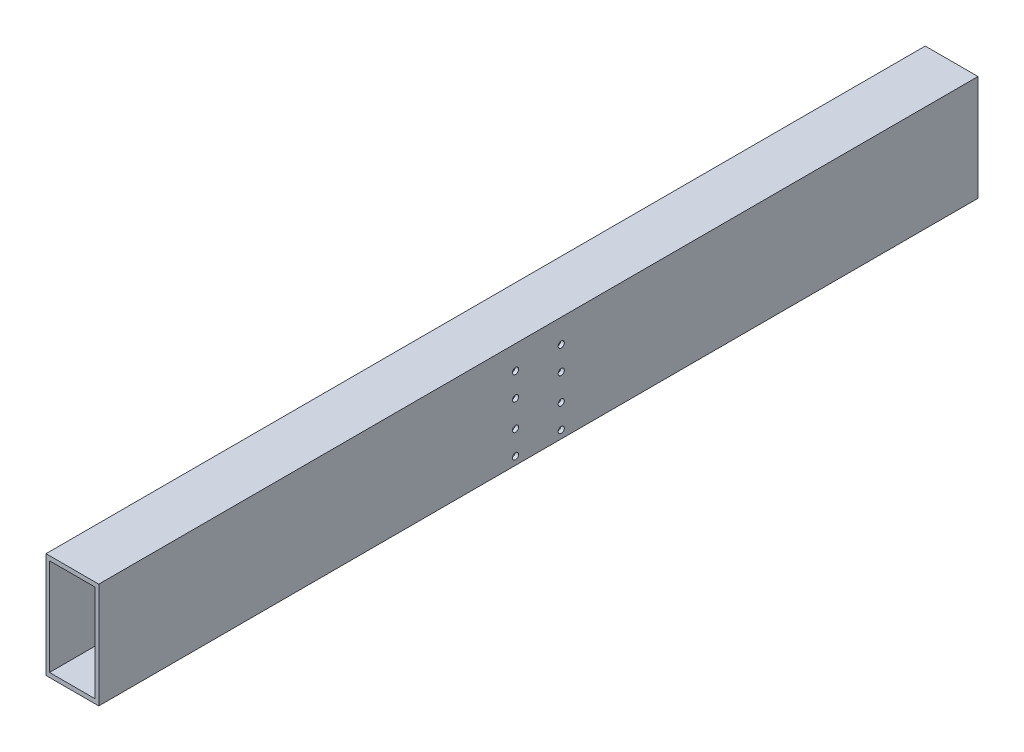
ISO-10303-21;
HEADER;
FILE_DESCRIPTION(('STEP AP214'),'2;1');
FILE_NAME('part.step','',(''),(''),'','','');
FILE_SCHEMA(('AUTOMOTIVE_DESIGN { 1 0 10303 214 1 1 1 1 }'));
ENDSEC;
DATA;
#1=APPLICATION_CONTEXT('core data for automotive mechanical design processes');
#2=APPLICATION_PROTOCOL_DEFINITION('international standard','automotive_design',2000,#1);
#3=PRODUCT_CONTEXT('',#1,'mechanical');
#4=PRODUCT('Part','Part','',(#3));
#5=PRODUCT_RELATED_PRODUCT_CATEGORY('part','',(#4));
#6=PRODUCT_DEFINITION_FORMATION('','',#4);
#7=PRODUCT_DEFINITION_CONTEXT('part definition',#1,'design');
#8=PRODUCT_DEFINITION('design','',#6,#7);
#9=PRODUCT_DEFINITION_SHAPE('','',#8);
#10=(LENGTH_UNIT() NAMED_UNIT(*) SI_UNIT(.MILLI.,.METRE.));
#11=(NAMED_UNIT(*) PLANE_ANGLE_UNIT() SI_UNIT($,.RADIAN.));
#12=(NAMED_UNIT(*) SI_UNIT($,.STERADIAN.) SOLID_ANGLE_UNIT());
#13=UNCERTAINTY_MEASURE_WITH_UNIT(LENGTH_MEASURE(1.E-05),#10,'distance_accuracy_value','');
#14=(GEOMETRIC_REPRESENTATION_CONTEXT(3) GLOBAL_UNCERTAINTY_ASSIGNED_CONTEXT((#13)) GLOBAL_UNIT_ASSIGNED_CONTEXT((#10,
#11,#12)) REPRESENTATION_CONTEXT('',''));
#15=CARTESIAN_POINT('',(0.,0.,0.));
#16=DIRECTION('',(0.,0.,1.));
#17=DIRECTION('',(1.,0.,0.));
#18=AXIS2_PLACEMENT_3D('',#15,#16,#17);
#19=CARTESIAN_POINT('',(-30.,60.,500.));
#20=DIRECTION('',(1.,0.,0.));
#21=DIRECTION('',(0.,0.,-1.));
#22=AXIS2_PLACEMENT_3D('',#19,#20,#21);
#23=PLANE('',#22);
#24=CARTESIAN_POINT('',(-30.,33.,26.));
#25=DIRECTION('',(1.,0.,0.));
#26=DIRECTION('',(0.,0.,-1.));
#27=AXIS2_PLACEMENT_3D('',#24,#25,#26);
#28=CIRCLE('',#27,3.49999999999999);
#29=CARTESIAN_POINT('',(-30.,33.,22.5));
#30=VERTEX_POINT('',#29);
#31=EDGE_CURVE('E539',#30,#30,#28,.T.);
#32=ORIENTED_EDGE('',*,*,#31,.T.);
#33=EDGE_LOOP('',(#32));
#34=FACE_BOUND('',#33,.T.);
#35=CARTESIAN_POINT('',(-30.,6.00000000000001,26.));
#36=DIRECTION('',(1.,0.,0.));
#37=DIRECTION('',(0.,0.,-1.));
#38=AXIS2_PLACEMENT_3D('',#35,#36,#37);
#39=CIRCLE('',#38,3.49999999999999);
#40=CARTESIAN_POINT('',(-30.,6.00000000000001,22.5));
#41=VERTEX_POINT('',#40);
#42=EDGE_CURVE('E553',#41,#41,#39,.T.);
#43=ORIENTED_EDGE('',*,*,#42,.T.);
#44=EDGE_LOOP('',(#43));
#45=FACE_BOUND('',#44,.T.);
#46=CARTESIAN_POINT('',(-30.,-24.,26.));
#47=DIRECTION('',(1.,0.,0.));
#48=DIRECTION('',(0.,0.,-1.));
#49=AXIS2_PLACEMENT_3D('',#46,#47,#48);
#50=CIRCLE('',#49,3.49999999999999);
#51=CARTESIAN_POINT('',(-30.,-24.,22.5));
#52=VERTEX_POINT('',#51);
#53=EDGE_CURVE('E148',#52,#52,#50,.T.);
#54=ORIENTED_EDGE('',*,*,#53,.T.);
#55=EDGE_LOOP('',(#54));
#56=FACE_BOUND('',#55,.T.);
#57=CARTESIAN_POINT('',(-30.,-51.,26.));
#58=DIRECTION('',(1.,0.,0.));
#59=DIRECTION('',(0.,0.,-1.));
#60=AXIS2_PLACEMENT_3D('',#57,#58,#59);
#61=CIRCLE('',#60,3.49999999999999);
#62=CARTESIAN_POINT('',(-30.,-51.,22.5));
#63=VERTEX_POINT('',#62);
#64=EDGE_CURVE('E144',#63,#63,#61,.T.);
#65=ORIENTED_EDGE('',*,*,#64,.T.);
#66=EDGE_LOOP('',(#65));
#67=FACE_BOUND('',#66,.T.);
#68=CARTESIAN_POINT('',(-30.,33.,-26.));
#69=DIRECTION('',(1.,0.,0.));
#70=DIRECTION('',(0.,0.,-1.));
#71=AXIS2_PLACEMENT_3D('',#68,#69,#70);
#72=CIRCLE('',#71,3.49999999999999);
#73=CARTESIAN_POINT('',(-30.,33.,-29.5));
#74=VERTEX_POINT('',#73);
#75=EDGE_CURVE('E140',#74,#74,#72,.T.);
#76=ORIENTED_EDGE('',*,*,#75,.T.);
#77=EDGE_LOOP('',(#76));
#78=FACE_BOUND('',#77,.T.);
#79=CARTESIAN_POINT('',(-30.,6.00000000000001,-26.));
#80=DIRECTION('',(1.,0.,0.));
#81=DIRECTION('',(0.,0.,-1.));
#82=AXIS2_PLACEMENT_3D('',#79,#80,#81);
#83=CIRCLE('',#82,3.49999999999999);
#84=CARTESIAN_POINT('',(-30.,6.00000000000001,-29.5));
#85=VERTEX_POINT('',#84);
#86=EDGE_CURVE('E135',#85,#85,#83,.T.);
#87=ORIENTED_EDGE('',*,*,#86,.T.);
#88=EDGE_LOOP('',(#87));
#89=FACE_BOUND('',#88,.T.);
#90=CARTESIAN_POINT('',(-30.,-24.,-26.));
#91=DIRECTION('',(1.,0.,0.));
#92=DIRECTION('',(0.,0.,-1.));
#93=AXIS2_PLACEMENT_3D('',#90,#91,#92);
#94=CIRCLE('',#93,3.49999999999999);
#95=CARTESIAN_POINT('',(-30.,-24.,-29.5));
#96=VERTEX_POINT('',#95);
#97=EDGE_CURVE('E130',#96,#96,#94,.T.);
#98=ORIENTED_EDGE('',*,*,#97,.T.);
#99=EDGE_LOOP('',(#98));
#100=FACE_BOUND('',#99,.T.);
#101=CARTESIAN_POINT('',(-30.,-51.,-26.));
#102=DIRECTION('',(1.,0.,0.));
#103=DIRECTION('',(0.,0.,-1.));
#104=AXIS2_PLACEMENT_3D('',#101,#102,#103);
#105=CIRCLE('',#104,3.49999999999999);
#106=CARTESIAN_POINT('',(-30.,-51.,-29.5));
#107=VERTEX_POINT('',#106);
#108=EDGE_CURVE('E125',#107,#107,#105,.T.);
#109=ORIENTED_EDGE('',*,*,#108,.T.);
#110=EDGE_LOOP('',(#109));
#111=FACE_BOUND('',#110,.T.);
#112=DIRECTION('',(0.,0.,-1.));
#113=VECTOR('',#112,1.);
#114=CARTESIAN_POINT('',(-30.,-60.,500.));
#115=LINE('',#114,#113);
#116=CARTESIAN_POINT('',(-30.,-60.,500.));
#117=VERTEX_POINT('',#116);
#118=CARTESIAN_POINT('',(-30.,-60.,-500.));
#119=VERTEX_POINT('',#118);
#120=EDGE_CURVE('E99',#117,#119,#115,.T.);
#121=ORIENTED_EDGE('',*,*,#120,.F.);
#122=DIRECTION('',(0.,-1.,0.));
#123=VECTOR('',#122,1.);
#124=CARTESIAN_POINT('',(-30.,60.,500.));
#125=LINE('',#124,#123);
#126=CARTESIAN_POINT('',(-30.,60.,500.));
#127=VERTEX_POINT('',#126);
#128=EDGE_CURVE('E87',#127,#117,#125,.T.);
#129=ORIENTED_EDGE('',*,*,#128,.F.);
#130=DIRECTION('',(0.,0.,-1.));
#131=VECTOR('',#130,1.);
#132=CARTESIAN_POINT('',(-30.,60.,500.));
#133=LINE('',#132,#131);
#134=CARTESIAN_POINT('',(-30.,60.,-500.));
#135=VERTEX_POINT('',#134);
#136=EDGE_CURVE('E104',#127,#135,#133,.T.);
#137=ORIENTED_EDGE('',*,*,#136,.T.);
#138=DIRECTION('',(0.,-1.,0.));
#139=VECTOR('',#138,1.);
#140=CARTESIAN_POINT('',(-30.,60.,-500.));
#141=LINE('',#140,#139);
#142=EDGE_CURVE('E100',#135,#119,#141,.T.);
#143=ORIENTED_EDGE('',*,*,#142,.T.);
#144=EDGE_LOOP('',(#121,#129,#137,#143));
#145=FACE_BOUND('',#144,.T.);
#146=ADVANCED_FACE('F35',(#34,#45,#56,#67,#78,#89,#100,#111,#145),#23,.F.);
#147=CARTESIAN_POINT('',(-30.,-60.,500.));
#148=DIRECTION('',(0.,1.,0.));
#149=DIRECTION('',(-1.,0.,0.));
#150=AXIS2_PLACEMENT_3D('',#147,#148,#149);
#151=PLANE('',#150);
#152=DIRECTION('',(0.,0.,-1.));
#153=VECTOR('',#152,1.);
#154=CARTESIAN_POINT('',(30.,-60.,500.));
#155=LINE('',#154,#153);
#156=CARTESIAN_POINT('',(30.,-60.,500.));
#157=VERTEX_POINT('',#156);
#158=CARTESIAN_POINT('',(30.,-60.,-500.));
#159=VERTEX_POINT('',#158);
#160=EDGE_CURVE('E103',#157,#159,#155,.T.);
#161=ORIENTED_EDGE('',*,*,#160,.F.);
#162=DIRECTION('',(1.,0.,0.));
#163=VECTOR('',#162,1.);
#164=CARTESIAN_POINT('',(-30.,-60.,500.));
#165=LINE('',#164,#163);
#166=EDGE_CURVE('E84',#117,#157,#165,.T.);
#167=ORIENTED_EDGE('',*,*,#166,.F.);
#168=ORIENTED_EDGE('',*,*,#120,.T.);
#169=DIRECTION('',(1.,0.,0.));
#170=VECTOR('',#169,1.);
#171=CARTESIAN_POINT('',(-30.,-60.,-500.));
#172=LINE('',#171,#170);
#173=EDGE_CURVE('E228',#119,#159,#172,.T.);
#174=ORIENTED_EDGE('',*,*,#173,.T.);
#175=EDGE_LOOP('',(#161,#167,#168,#174));
#176=FACE_BOUND('',#175,.T.);
#177=ADVANCED_FACE('F106',(#176),#151,.F.);
#178=CARTESIAN_POINT('',(30.,60.,500.));
#179=DIRECTION('',(-1.,0.,0.));
#180=DIRECTION('',(0.,-1.,0.));
#181=AXIS2_PLACEMENT_3D('',#178,#179,#180);
#182=PLANE('',#181);
#183=CARTESIAN_POINT('',(30.,33.,26.));
#184=DIRECTION('',(1.,0.,0.));
#185=DIRECTION('',(0.,0.,-1.));
#186=AXIS2_PLACEMENT_3D('',#183,#184,#185);
#187=CIRCLE('',#186,3.49999999999999);
#188=CARTESIAN_POINT('',(30.,33.,22.5));
#189=VERTEX_POINT('',#188);
#190=EDGE_CURVE('E547',#189,#189,#187,.T.);
#191=ORIENTED_EDGE('',*,*,#190,.F.);
#192=EDGE_LOOP('',(#191));
#193=FACE_BOUND('',#192,.T.);
#194=CARTESIAN_POINT('',(30.,6.00000000000001,26.));
#195=DIRECTION('',(1.,0.,0.));
#196=DIRECTION('',(0.,0.,-1.));
#197=AXIS2_PLACEMENT_3D('',#194,#195,#196);
#198=CIRCLE('',#197,3.49999999999999);
#199=CARTESIAN_POINT('',(30.,6.00000000000001,22.5));
#200=VERTEX_POINT('',#199);
#201=EDGE_CURVE('E545',#200,#200,#198,.T.);
#202=ORIENTED_EDGE('',*,*,#201,.F.);
#203=EDGE_LOOP('',(#202));
#204=FACE_BOUND('',#203,.T.);
#205=CARTESIAN_POINT('',(30.,-24.,26.));
#206=DIRECTION('',(1.,0.,0.));
#207=DIRECTION('',(0.,0.,-1.));
#208=AXIS2_PLACEMENT_3D('',#205,#206,#207);
#209=CIRCLE('',#208,3.49999999999999);
#210=CARTESIAN_POINT('',(30.,-24.,22.5));
#211=VERTEX_POINT('',#210);
#212=EDGE_CURVE('E155',#211,#211,#209,.T.);
#213=ORIENTED_EDGE('',*,*,#212,.F.);
#214=EDGE_LOOP('',(#213));
#215=FACE_BOUND('',#214,.T.);
#216=CARTESIAN_POINT('',(30.,-51.,26.));
#217=DIRECTION('',(1.,0.,0.));
#218=DIRECTION('',(0.,0.,-1.));
#219=AXIS2_PLACEMENT_3D('',#216,#217,#218);
#220=CIRCLE('',#219,3.49999999999999);
#221=CARTESIAN_POINT('',(30.,-51.,22.5));
#222=VERTEX_POINT('',#221);
#223=EDGE_CURVE('E152',#222,#222,#220,.T.);
#224=ORIENTED_EDGE('',*,*,#223,.F.);
#225=EDGE_LOOP('',(#224));
#226=FACE_BOUND('',#225,.T.);
#227=CARTESIAN_POINT('',(30.,33.,-26.));
#228=DIRECTION('',(1.,0.,0.));
#229=DIRECTION('',(0.,0.,-1.));
#230=AXIS2_PLACEMENT_3D('',#227,#228,#229);
#231=CIRCLE('',#230,3.49999999999999);
#232=CARTESIAN_POINT('',(30.,33.,-29.5));
#233=VERTEX_POINT('',#232);
#234=EDGE_CURVE('E170',#233,#233,#231,.T.);
#235=ORIENTED_EDGE('',*,*,#234,.F.);
#236=EDGE_LOOP('',(#235));
#237=FACE_BOUND('',#236,.T.);
#238=CARTESIAN_POINT('',(30.,6.00000000000001,-26.));
#239=DIRECTION('',(1.,0.,0.));
#240=DIRECTION('',(0.,0.,-1.));
#241=AXIS2_PLACEMENT_3D('',#238,#239,#240);
#242=CIRCLE('',#241,3.49999999999999);
#243=CARTESIAN_POINT('',(30.,6.00000000000001,-29.5));
#244=VERTEX_POINT('',#243);
#245=EDGE_CURVE('E177',#244,#244,#242,.T.);
#246=ORIENTED_EDGE('',*,*,#245,.F.);
#247=EDGE_LOOP('',(#246));
#248=FACE_BOUND('',#247,.T.);
#249=CARTESIAN_POINT('',(30.,-24.,-26.));
#250=DIRECTION('',(1.,0.,0.));
#251=DIRECTION('',(0.,0.,-1.));
#252=AXIS2_PLACEMENT_3D('',#249,#250,#251);
#253=CIRCLE('',#252,3.49999999999999);
#254=CARTESIAN_POINT('',(30.,-24.,-29.5));
#255=VERTEX_POINT('',#254);
#256=EDGE_CURVE('E184',#255,#255,#253,.T.);
#257=ORIENTED_EDGE('',*,*,#256,.F.);
#258=EDGE_LOOP('',(#257));
#259=FACE_BOUND('',#258,.T.);
#260=CARTESIAN_POINT('',(30.,-51.,-26.));
#261=DIRECTION('',(1.,0.,0.));
#262=DIRECTION('',(0.,0.,-1.));
#263=AXIS2_PLACEMENT_3D('',#260,#261,#262);
#264=CIRCLE('',#263,3.49999999999999);
#265=CARTESIAN_POINT('',(30.,-51.,-29.5));
#266=VERTEX_POINT('',#265);
#267=EDGE_CURVE('E191',#266,#266,#264,.T.);
#268=ORIENTED_EDGE('',*,*,#267,.F.);
#269=EDGE_LOOP('',(#268));
#270=FACE_BOUND('',#269,.T.);
#271=DIRECTION('',(0.,0.,-1.));
#272=VECTOR('',#271,1.);
#273=CARTESIAN_POINT('',(30.,60.,500.));
#274=LINE('',#273,#272);
#275=CARTESIAN_POINT('',(30.,60.,500.));
#276=VERTEX_POINT('',#275);
#277=CARTESIAN_POINT('',(30.,60.,-500.));
#278=VERTEX_POINT('',#277);
#279=EDGE_CURVE('E95',#276,#278,#274,.T.);
#280=ORIENTED_EDGE('',*,*,#279,.F.);
#281=DIRECTION('',(0.,1.,0.));
#282=VECTOR('',#281,1.);
#283=CARTESIAN_POINT('',(30.,60.,500.));
#284=LINE('',#283,#282);
#285=EDGE_CURVE('E109',#157,#276,#284,.T.);
#286=ORIENTED_EDGE('',*,*,#285,.F.);
#287=ORIENTED_EDGE('',*,*,#160,.T.);
#288=DIRECTION('',(0.,1.,0.));
#289=VECTOR('',#288,1.);
#290=CARTESIAN_POINT('',(30.,60.,-500.));
#291=LINE('',#290,#289);
#292=EDGE_CURVE('E113',#159,#278,#291,.T.);
#293=ORIENTED_EDGE('',*,*,#292,.T.);
#294=EDGE_LOOP('',(#280,#286,#287,#293));
#295=FACE_BOUND('',#294,.T.);
#296=ADVANCED_FACE('F235',(#193,#204,#215,#226,#237,#248,#259,#270,#295),#182,.F.);
#297=CARTESIAN_POINT('',(-30.,60.,500.));
#298=DIRECTION('',(0.,-1.,0.));
#299=DIRECTION('',(1.,0.,0.));
#300=AXIS2_PLACEMENT_3D('',#297,#298,#299);
#301=PLANE('',#300);
#302=DIRECTION('',(-1.,0.,0.));
#303=VECTOR('',#302,1.);
#304=CARTESIAN_POINT('',(-30.,60.,-500.));
#305=LINE('',#304,#303);
#306=EDGE_CURVE('E202',#278,#135,#305,.T.);
#307=ORIENTED_EDGE('',*,*,#306,.T.);
#308=ORIENTED_EDGE('',*,*,#136,.F.);
#309=DIRECTION('',(-1.,0.,0.));
#310=VECTOR('',#309,1.);
#311=CARTESIAN_POINT('',(-30.,60.,500.));
#312=LINE('',#311,#310);
#313=EDGE_CURVE('E91',#276,#127,#312,.T.);
#314=ORIENTED_EDGE('',*,*,#313,.F.);
#315=ORIENTED_EDGE('',*,*,#279,.T.);
#316=EDGE_LOOP('',(#307,#308,#314,#315));
#317=FACE_BOUND('',#316,.T.);
#318=ADVANCED_FACE('F37',(#317),#301,.F.);
#319=CARTESIAN_POINT('',(0.,0.,500.));
#320=DIRECTION('',(0.,0.,1.));
#321=DIRECTION('',(1.,0.,0.));
#322=AXIS2_PLACEMENT_3D('',#319,#320,#321);
#323=PLANE('',#322);
#324=DIRECTION('',(0.,-1.,0.));
#325=VECTOR('',#324,1.);
#326=CARTESIAN_POINT('',(-26.,55.,500.));
#327=LINE('',#326,#325);
#328=CARTESIAN_POINT('',(-26.,-55.,500.));
#329=VERTEX_POINT('',#328);
#330=CARTESIAN_POINT('',(-26.,55.,500.));
#331=VERTEX_POINT('',#330);
#332=EDGE_CURVE('E215',#329,#331,#327,.F.);
#333=ORIENTED_EDGE('',*,*,#332,.T.);
#334=DIRECTION('',(-1.,0.,0.));
#335=VECTOR('',#334,1.);
#336=CARTESIAN_POINT('',(-26.,55.,500.));
#337=LINE('',#336,#335);
#338=CARTESIAN_POINT('',(26.,55.,500.));
#339=VERTEX_POINT('',#338);
#340=EDGE_CURVE('E198',#331,#339,#337,.F.);
#341=ORIENTED_EDGE('',*,*,#340,.T.);
#342=DIRECTION('',(0.,1.,0.));
#343=VECTOR('',#342,1.);
#344=CARTESIAN_POINT('',(26.,55.,500.));
#345=LINE('',#344,#343);
#346=CARTESIAN_POINT('',(26.,-55.,500.));
#347=VERTEX_POINT('',#346);
#348=EDGE_CURVE('E201',#339,#347,#345,.F.);
#349=ORIENTED_EDGE('',*,*,#348,.T.);
#350=DIRECTION('',(1.,0.,0.));
#351=VECTOR('',#350,1.);
#352=CARTESIAN_POINT('',(-26.,-55.,500.));
#353=LINE('',#352,#351);
#354=EDGE_CURVE('E218',#347,#329,#353,.F.);
#355=ORIENTED_EDGE('',*,*,#354,.T.);
#356=EDGE_LOOP('',(#333,#341,#349,#355));
#357=FACE_BOUND('',#356,.T.);
#358=ORIENTED_EDGE('',*,*,#128,.T.);
#359=ORIENTED_EDGE('',*,*,#166,.T.);
#360=ORIENTED_EDGE('',*,*,#285,.T.);
#361=ORIENTED_EDGE('',*,*,#313,.T.);
#362=EDGE_LOOP('',(#358,#359,#360,#361));
#363=FACE_BOUND('',#362,.T.);
#364=ADVANCED_FACE('F89',(#357,#363),#323,.T.);
#365=CARTESIAN_POINT('',(0.,0.,-500.));
#366=DIRECTION('',(0.,0.,1.));
#367=DIRECTION('',(1.,0.,0.));
#368=AXIS2_PLACEMENT_3D('',#365,#366,#367);
#369=PLANE('',#368);
#370=DIRECTION('',(0.,-1.,0.));
#371=VECTOR('',#370,1.);
#372=CARTESIAN_POINT('',(-26.,55.,-500.));
#373=LINE('',#372,#371);
#374=CARTESIAN_POINT('',(-26.,-55.,-500.));
#375=VERTEX_POINT('',#374);
#376=CARTESIAN_POINT('',(-26.,55.,-500.));
#377=VERTEX_POINT('',#376);
#378=EDGE_CURVE('E11',#375,#377,#373,.F.);
#379=ORIENTED_EDGE('',*,*,#378,.F.);
#380=DIRECTION('',(1.,0.,0.));
#381=VECTOR('',#380,1.);
#382=CARTESIAN_POINT('',(-26.,-55.,-500.));
#383=LINE('',#382,#381);
#384=CARTESIAN_POINT('',(26.,-55.,-500.));
#385=VERTEX_POINT('',#384);
#386=EDGE_CURVE('E45',#385,#375,#383,.F.);
#387=ORIENTED_EDGE('',*,*,#386,.F.);
#388=DIRECTION('',(0.,1.,0.));
#389=VECTOR('',#388,1.);
#390=CARTESIAN_POINT('',(26.,55.,-500.));
#391=LINE('',#390,#389);
#392=CARTESIAN_POINT('',(26.,55.,-500.));
#393=VERTEX_POINT('',#392);
#394=EDGE_CURVE('E206',#393,#385,#391,.F.);
#395=ORIENTED_EDGE('',*,*,#394,.F.);
#396=DIRECTION('',(-1.,0.,0.));
#397=VECTOR('',#396,1.);
#398=CARTESIAN_POINT('',(-26.,55.,-500.));
#399=LINE('',#398,#397);
#400=EDGE_CURVE('E203',#377,#393,#399,.F.);
#401=ORIENTED_EDGE('',*,*,#400,.F.);
#402=EDGE_LOOP('',(#379,#387,#395,#401));
#403=FACE_BOUND('',#402,.T.);
#404=ORIENTED_EDGE('',*,*,#142,.F.);
#405=ORIENTED_EDGE('',*,*,#306,.F.);
#406=ORIENTED_EDGE('',*,*,#292,.F.);
#407=ORIENTED_EDGE('',*,*,#173,.F.);
#408=EDGE_LOOP('',(#404,#405,#406,#407));
#409=FACE_BOUND('',#408,.T.);
#410=ADVANCED_FACE('F237',(#403,#409),#369,.F.);
#411=CARTESIAN_POINT('',(-26.,55.,500.));
#412=DIRECTION('',(0.,1.,0.));
#413=DIRECTION('',(-1.,0.,0.));
#414=AXIS2_PLACEMENT_3D('',#411,#412,#413);
#415=PLANE('',#414);
#416=DIRECTION('',(0.,0.,-1.));
#417=VECTOR('',#416,1.);
#418=CARTESIAN_POINT('',(26.,55.,500.));
#419=LINE('',#418,#417);
#420=EDGE_CURVE('E208',#339,#393,#419,.T.);
#421=ORIENTED_EDGE('',*,*,#420,.F.);
#422=ORIENTED_EDGE('',*,*,#340,.F.);
#423=DIRECTION('',(0.,0.,-1.));
#424=VECTOR('',#423,1.);
#425=CARTESIAN_POINT('',(-26.,55.,500.));
#426=LINE('',#425,#424);
#427=EDGE_CURVE('E212',#331,#377,#426,.T.);
#428=ORIENTED_EDGE('',*,*,#427,.T.);
#429=ORIENTED_EDGE('',*,*,#400,.T.);
#430=EDGE_LOOP('',(#421,#422,#428,#429));
#431=FACE_BOUND('',#430,.T.);
#432=ADVANCED_FACE('F266',(#431),#415,.F.);
#433=CARTESIAN_POINT('',(26.,55.,500.));
#434=DIRECTION('',(1.,0.,0.));
#435=DIRECTION('',(0.,0.,-1.));
#436=AXIS2_PLACEMENT_3D('',#433,#434,#435);
#437=PLANE('',#436);
#438=CARTESIAN_POINT('',(26.,33.,26.));
#439=DIRECTION('',(1.,0.,0.));
#440=DIRECTION('',(0.,0.,-1.));
#441=AXIS2_PLACEMENT_3D('',#438,#439,#440);
#442=CIRCLE('',#441,3.49999999999999);
#443=CARTESIAN_POINT('',(26.,33.,22.5));
#444=VERTEX_POINT('',#443);
#445=EDGE_CURVE('E542',#444,#444,#442,.T.);
#446=ORIENTED_EDGE('',*,*,#445,.T.);
#447=EDGE_LOOP('',(#446));
#448=FACE_BOUND('',#447,.T.);
#449=CARTESIAN_POINT('',(26.,6.00000000000001,26.));
#450=DIRECTION('',(1.,0.,0.));
#451=DIRECTION('',(0.,0.,-1.));
#452=AXIS2_PLACEMENT_3D('',#449,#450,#451);
#453=CIRCLE('',#452,3.49999999999999);
#454=CARTESIAN_POINT('',(26.,6.00000000000001,22.5));
#455=VERTEX_POINT('',#454);
#456=EDGE_CURVE('E160',#455,#455,#453,.T.);
#457=ORIENTED_EDGE('',*,*,#456,.T.);
#458=EDGE_LOOP('',(#457));
#459=FACE_BOUND('',#458,.T.);
#460=CARTESIAN_POINT('',(26.,-24.,26.));
#461=DIRECTION('',(1.,0.,0.));
#462=DIRECTION('',(0.,0.,-1.));
#463=AXIS2_PLACEMENT_3D('',#460,#461,#462);
#464=CIRCLE('',#463,3.49999999999999);
#465=CARTESIAN_POINT('',(26.,-24.,22.5));
#466=VERTEX_POINT('',#465);
#467=EDGE_CURVE('E147',#466,#466,#464,.T.);
#468=ORIENTED_EDGE('',*,*,#467,.T.);
#469=EDGE_LOOP('',(#468));
#470=FACE_BOUND('',#469,.T.);
#471=CARTESIAN_POINT('',(26.,-51.,26.));
#472=DIRECTION('',(1.,0.,0.));
#473=DIRECTION('',(0.,0.,-1.));
#474=AXIS2_PLACEMENT_3D('',#471,#472,#473);
#475=CIRCLE('',#474,3.49999999999999);
#476=CARTESIAN_POINT('',(26.,-51.,22.5));
#477=VERTEX_POINT('',#476);
#478=EDGE_CURVE('E143',#477,#477,#475,.T.);
#479=ORIENTED_EDGE('',*,*,#478,.T.);
#480=EDGE_LOOP('',(#479));
#481=FACE_BOUND('',#480,.T.);
#482=CARTESIAN_POINT('',(26.,33.,-26.));
#483=DIRECTION('',(1.,0.,0.));
#484=DIRECTION('',(0.,0.,-1.));
#485=AXIS2_PLACEMENT_3D('',#482,#483,#484);
#486=CIRCLE('',#485,3.49999999999999);
#487=CARTESIAN_POINT('',(26.,33.,-29.5));
#488=VERTEX_POINT('',#487);
#489=EDGE_CURVE('E139',#488,#488,#486,.T.);
#490=ORIENTED_EDGE('',*,*,#489,.T.);
#491=EDGE_LOOP('',(#490));
#492=FACE_BOUND('',#491,.T.);
#493=CARTESIAN_POINT('',(26.,6.00000000000001,-26.));
#494=DIRECTION('',(1.,0.,0.));
#495=DIRECTION('',(0.,0.,-1.));
#496=AXIS2_PLACEMENT_3D('',#493,#494,#495);
#497=CIRCLE('',#496,3.49999999999999);
#498=CARTESIAN_POINT('',(26.,6.00000000000001,-29.5));
#499=VERTEX_POINT('',#498);
#500=EDGE_CURVE('E134',#499,#499,#497,.T.);
#501=ORIENTED_EDGE('',*,*,#500,.T.);
#502=EDGE_LOOP('',(#501));
#503=FACE_BOUND('',#502,.T.);
#504=CARTESIAN_POINT('',(26.,-24.,-26.));
#505=DIRECTION('',(1.,0.,0.));
#506=DIRECTION('',(0.,0.,-1.));
#507=AXIS2_PLACEMENT_3D('',#504,#505,#506);
#508=CIRCLE('',#507,3.49999999999999);
#509=CARTESIAN_POINT('',(26.,-24.,-29.5));
#510=VERTEX_POINT('',#509);
#511=EDGE_CURVE('E126',#510,#510,#508,.T.);
#512=ORIENTED_EDGE('',*,*,#511,.T.);
#513=EDGE_LOOP('',(#512));
#514=FACE_BOUND('',#513,.T.);
#515=CARTESIAN_POINT('',(26.,-51.,-26.));
#516=DIRECTION('',(1.,0.,0.));
#517=DIRECTION('',(0.,0.,-1.));
#518=AXIS2_PLACEMENT_3D('',#515,#516,#517);
#519=CIRCLE('',#518,3.49999999999999);
#520=CARTESIAN_POINT('',(26.,-51.,-29.5));
#521=VERTEX_POINT('',#520);
#522=EDGE_CURVE('E118',#521,#521,#519,.T.);
#523=ORIENTED_EDGE('',*,*,#522,.T.);
#524=EDGE_LOOP('',(#523));
#525=FACE_BOUND('',#524,.T.);
#526=DIRECTION('',(0.,0.,-1.));
#527=VECTOR('',#526,1.);
#528=CARTESIAN_POINT('',(26.,-55.,500.));
#529=LINE('',#528,#527);
#530=EDGE_CURVE('E211',#347,#385,#529,.T.);
#531=ORIENTED_EDGE('',*,*,#530,.F.);
#532=ORIENTED_EDGE('',*,*,#348,.F.);
#533=ORIENTED_EDGE('',*,*,#420,.T.);
#534=ORIENTED_EDGE('',*,*,#394,.T.);
#535=EDGE_LOOP('',(#531,#532,#533,#534));
#536=FACE_BOUND('',#535,.T.);
#537=ADVANCED_FACE('F259',(#448,#459,#470,#481,#492,#503,#514,#525,#536),#437,.F.);
#538=CARTESIAN_POINT('',(-26.,-55.,500.));
#539=DIRECTION('',(0.,-1.,0.));
#540=DIRECTION('',(1.,0.,0.));
#541=AXIS2_PLACEMENT_3D('',#538,#539,#540);
#542=PLANE('',#541);
#543=DIRECTION('',(0.,0.,-1.));
#544=VECTOR('',#543,1.);
#545=CARTESIAN_POINT('',(-26.,-55.,500.));
#546=LINE('',#545,#544);
#547=EDGE_CURVE('E207',#329,#375,#546,.T.);
#548=ORIENTED_EDGE('',*,*,#547,.F.);
#549=ORIENTED_EDGE('',*,*,#354,.F.);
#550=ORIENTED_EDGE('',*,*,#530,.T.);
#551=ORIENTED_EDGE('',*,*,#386,.T.);
#552=EDGE_LOOP('',(#548,#549,#550,#551));
#553=FACE_BOUND('',#552,.T.);
#554=ADVANCED_FACE('F249',(#553),#542,.F.);
#555=CARTESIAN_POINT('',(-26.,55.,500.));
#556=DIRECTION('',(-1.,0.,0.));
#557=DIRECTION('',(0.,0.,1.));
#558=AXIS2_PLACEMENT_3D('',#555,#556,#557);
#559=PLANE('',#558);
#560=CARTESIAN_POINT('',(-26.,33.,26.));
#561=DIRECTION('',(-1.,0.,0.));
#562=DIRECTION('',(0.,0.,1.));
#563=AXIS2_PLACEMENT_3D('',#560,#561,#562);
#564=CIRCLE('',#563,3.49999999999999);
#565=CARTESIAN_POINT('',(-26.,33.,29.5));
#566=VERTEX_POINT('',#565);
#567=EDGE_CURVE('E541',#566,#566,#564,.T.);
#568=ORIENTED_EDGE('',*,*,#567,.T.);
#569=EDGE_LOOP('',(#568));
#570=FACE_BOUND('',#569,.T.);
#571=CARTESIAN_POINT('',(-26.,6.00000000000001,26.));
#572=DIRECTION('',(-1.,0.,0.));
#573=DIRECTION('',(0.,0.,1.));
#574=AXIS2_PLACEMENT_3D('',#571,#572,#573);
#575=CIRCLE('',#574,3.49999999999999);
#576=CARTESIAN_POINT('',(-26.,6.00000000000001,29.5));
#577=VERTEX_POINT('',#576);
#578=EDGE_CURVE('E39',#577,#577,#575,.T.);
#579=ORIENTED_EDGE('',*,*,#578,.T.);
#580=EDGE_LOOP('',(#579));
#581=FACE_BOUND('',#580,.T.);
#582=CARTESIAN_POINT('',(-26.,-24.,26.));
#583=DIRECTION('',(-1.,0.,0.));
#584=DIRECTION('',(0.,0.,1.));
#585=AXIS2_PLACEMENT_3D('',#582,#583,#584);
#586=CIRCLE('',#585,3.49999999999999);
#587=CARTESIAN_POINT('',(-26.,-24.,29.5));
#588=VERTEX_POINT('',#587);
#589=EDGE_CURVE('E145',#588,#588,#586,.T.);
#590=ORIENTED_EDGE('',*,*,#589,.T.);
#591=EDGE_LOOP('',(#590));
#592=FACE_BOUND('',#591,.T.);
#593=CARTESIAN_POINT('',(-26.,-51.,26.));
#594=DIRECTION('',(-1.,0.,0.));
#595=DIRECTION('',(0.,0.,1.));
#596=AXIS2_PLACEMENT_3D('',#593,#594,#595);
#597=CIRCLE('',#596,3.49999999999999);
#598=CARTESIAN_POINT('',(-26.,-51.,29.5));
#599=VERTEX_POINT('',#598);
#600=EDGE_CURVE('E141',#599,#599,#597,.T.);
#601=ORIENTED_EDGE('',*,*,#600,.T.);
#602=EDGE_LOOP('',(#601));
#603=FACE_BOUND('',#602,.T.);
#604=CARTESIAN_POINT('',(-26.,33.,-26.));
#605=DIRECTION('',(-1.,0.,0.));
#606=DIRECTION('',(0.,0.,1.));
#607=AXIS2_PLACEMENT_3D('',#604,#605,#606);
#608=CIRCLE('',#607,3.49999999999999);
#609=CARTESIAN_POINT('',(-26.,33.,-22.5));
#610=VERTEX_POINT('',#609);
#611=EDGE_CURVE('E136',#610,#610,#608,.T.);
#612=ORIENTED_EDGE('',*,*,#611,.T.);
#613=EDGE_LOOP('',(#612));
#614=FACE_BOUND('',#613,.T.);
#615=CARTESIAN_POINT('',(-26.,6.00000000000001,-26.));
#616=DIRECTION('',(-1.,0.,0.));
#617=DIRECTION('',(0.,0.,1.));
#618=AXIS2_PLACEMENT_3D('',#615,#616,#617);
#619=CIRCLE('',#618,3.49999999999999);
#620=CARTESIAN_POINT('',(-26.,6.00000000000001,-22.5));
#621=VERTEX_POINT('',#620);
#622=EDGE_CURVE('E131',#621,#621,#619,.T.);
#623=ORIENTED_EDGE('',*,*,#622,.T.);
#624=EDGE_LOOP('',(#623));
#625=FACE_BOUND('',#624,.T.);
#626=CARTESIAN_POINT('',(-26.,-24.,-26.));
#627=DIRECTION('',(-1.,0.,0.));
#628=DIRECTION('',(0.,0.,1.));
#629=AXIS2_PLACEMENT_3D('',#626,#627,#628);
#630=CIRCLE('',#629,3.49999999999999);
#631=CARTESIAN_POINT('',(-26.,-24.,-22.5));
#632=VERTEX_POINT('',#631);
#633=EDGE_CURVE('E129',#632,#632,#630,.T.);
#634=ORIENTED_EDGE('',*,*,#633,.T.);
#635=EDGE_LOOP('',(#634));
#636=FACE_BOUND('',#635,.T.);
#637=CARTESIAN_POINT('',(-26.,-51.,-26.));
#638=DIRECTION('',(-1.,0.,0.));
#639=DIRECTION('',(0.,0.,1.));
#640=AXIS2_PLACEMENT_3D('',#637,#638,#639);
#641=CIRCLE('',#640,3.49999999999999);
#642=CARTESIAN_POINT('',(-26.,-51.,-22.5));
#643=VERTEX_POINT('',#642);
#644=EDGE_CURVE('E122',#643,#643,#641,.T.);
#645=ORIENTED_EDGE('',*,*,#644,.T.);
#646=EDGE_LOOP('',(#645));
#647=FACE_BOUND('',#646,.T.);
#648=ORIENTED_EDGE('',*,*,#378,.T.);
#649=ORIENTED_EDGE('',*,*,#427,.F.);
#650=ORIENTED_EDGE('',*,*,#332,.F.);
#651=ORIENTED_EDGE('',*,*,#547,.T.);
#652=EDGE_LOOP('',(#648,#649,#650,#651));
#653=FACE_BOUND('',#652,.T.);
#654=ADVANCED_FACE('F246',(#570,#581,#592,#603,#614,#625,#636,#647,#653),#559,.F.);
#655=CARTESIAN_POINT('',(30.,-51.,-26.));
#656=DIRECTION('',(1.,0.,0.));
#657=DIRECTION('',(0.,0.,-1.));
#658=AXIS2_PLACEMENT_3D('',#655,#656,#657);
#659=CYLINDRICAL_SURFACE('',#658,3.49999999999999);
#660=ORIENTED_EDGE('',*,*,#108,.F.);
#661=EDGE_LOOP('',(#660));
#662=FACE_BOUND('',#661,.T.);
#663=ORIENTED_EDGE('',*,*,#644,.F.);
#664=EDGE_LOOP('',(#663));
#665=FACE_BOUND('',#664,.T.);
#666=ADVANCED_FACE('F248',(#662,#665),#659,.F.);
#667=ORIENTED_EDGE('',*,*,#267,.T.);
#668=EDGE_LOOP('',(#667));
#669=FACE_BOUND('',#668,.T.);
#670=ORIENTED_EDGE('',*,*,#522,.F.);
#671=EDGE_LOOP('',(#670));
#672=FACE_BOUND('',#671,.T.);
#673=ADVANCED_FACE('F256',(#669,#672),#659,.F.);
#674=CARTESIAN_POINT('',(30.,-24.,-26.));
#675=DIRECTION('',(1.,0.,0.));
#676=DIRECTION('',(0.,0.,-1.));
#677=AXIS2_PLACEMENT_3D('',#674,#675,#676);
#678=CYLINDRICAL_SURFACE('',#677,3.49999999999999);
#679=ORIENTED_EDGE('',*,*,#256,.T.);
#680=EDGE_LOOP('',(#679));
#681=FACE_BOUND('',#680,.T.);
#682=ORIENTED_EDGE('',*,*,#511,.F.);
#683=EDGE_LOOP('',(#682));
#684=FACE_BOUND('',#683,.T.);
#685=ADVANCED_FACE('F397',(#681,#684),#678,.F.);
#686=ORIENTED_EDGE('',*,*,#97,.F.);
#687=EDGE_LOOP('',(#686));
#688=FACE_BOUND('',#687,.T.);
#689=ORIENTED_EDGE('',*,*,#633,.F.);
#690=EDGE_LOOP('',(#689));
#691=FACE_BOUND('',#690,.T.);
#692=ADVANCED_FACE('F395',(#688,#691),#678,.F.);
#693=CARTESIAN_POINT('',(30.,6.00000000000001,-26.));
#694=DIRECTION('',(1.,0.,0.));
#695=DIRECTION('',(0.,0.,-1.));
#696=AXIS2_PLACEMENT_3D('',#693,#694,#695);
#697=CYLINDRICAL_SURFACE('',#696,3.49999999999999);
#698=ORIENTED_EDGE('',*,*,#86,.F.);
#699=EDGE_LOOP('',(#698));
#700=FACE_BOUND('',#699,.T.);
#701=ORIENTED_EDGE('',*,*,#622,.F.);
#702=EDGE_LOOP('',(#701));
#703=FACE_BOUND('',#702,.T.);
#704=ADVANCED_FACE('F393',(#700,#703),#697,.F.);
#705=ORIENTED_EDGE('',*,*,#245,.T.);
#706=EDGE_LOOP('',(#705));
#707=FACE_BOUND('',#706,.T.);
#708=ORIENTED_EDGE('',*,*,#500,.F.);
#709=EDGE_LOOP('',(#708));
#710=FACE_BOUND('',#709,.T.);
#711=ADVANCED_FACE('F390',(#707,#710),#697,.F.);
#712=CARTESIAN_POINT('',(30.,33.,-26.));
#713=DIRECTION('',(1.,0.,0.));
#714=DIRECTION('',(0.,0.,-1.));
#715=AXIS2_PLACEMENT_3D('',#712,#713,#714);
#716=CYLINDRICAL_SURFACE('',#715,3.49999999999999);
#717=ORIENTED_EDGE('',*,*,#75,.F.);
#718=EDGE_LOOP('',(#717));
#719=FACE_BOUND('',#718,.T.);
#720=ORIENTED_EDGE('',*,*,#611,.F.);
#721=EDGE_LOOP('',(#720));
#722=FACE_BOUND('',#721,.T.);
#723=ADVANCED_FACE('F388',(#719,#722),#716,.F.);
#724=ORIENTED_EDGE('',*,*,#234,.T.);
#725=EDGE_LOOP('',(#724));
#726=FACE_BOUND('',#725,.T.);
#727=ORIENTED_EDGE('',*,*,#489,.F.);
#728=EDGE_LOOP('',(#727));
#729=FACE_BOUND('',#728,.T.);
#730=ADVANCED_FACE('F312',(#726,#729),#716,.F.);
#731=CARTESIAN_POINT('',(30.,-51.,26.));
#732=DIRECTION('',(1.,0.,0.));
#733=DIRECTION('',(0.,0.,-1.));
#734=AXIS2_PLACEMENT_3D('',#731,#732,#733);
#735=CYLINDRICAL_SURFACE('',#734,3.49999999999999);
#736=ORIENTED_EDGE('',*,*,#64,.F.);
#737=EDGE_LOOP('',(#736));
#738=FACE_BOUND('',#737,.T.);
#739=ORIENTED_EDGE('',*,*,#600,.F.);
#740=EDGE_LOOP('',(#739));
#741=FACE_BOUND('',#740,.T.);
#742=ADVANCED_FACE('F306',(#738,#741),#735,.F.);
#743=ORIENTED_EDGE('',*,*,#223,.T.);
#744=EDGE_LOOP('',(#743));
#745=FACE_BOUND('',#744,.T.);
#746=ORIENTED_EDGE('',*,*,#478,.F.);
#747=EDGE_LOOP('',(#746));
#748=FACE_BOUND('',#747,.T.);
#749=ADVANCED_FACE('F311',(#745,#748),#735,.F.);
#750=CARTESIAN_POINT('',(30.,-24.,26.));
#751=DIRECTION('',(1.,0.,0.));
#752=DIRECTION('',(0.,0.,-1.));
#753=AXIS2_PLACEMENT_3D('',#750,#751,#752);
#754=CYLINDRICAL_SURFACE('',#753,3.49999999999999);
#755=ORIENTED_EDGE('',*,*,#53,.F.);
#756=EDGE_LOOP('',(#755));
#757=FACE_BOUND('',#756,.T.);
#758=ORIENTED_EDGE('',*,*,#589,.F.);
#759=EDGE_LOOP('',(#758));
#760=FACE_BOUND('',#759,.T.);
#761=ADVANCED_FACE('F324',(#757,#760),#754,.F.);
#762=ORIENTED_EDGE('',*,*,#212,.T.);
#763=EDGE_LOOP('',(#762));
#764=FACE_BOUND('',#763,.T.);
#765=ORIENTED_EDGE('',*,*,#467,.F.);
#766=EDGE_LOOP('',(#765));
#767=FACE_BOUND('',#766,.T.);
#768=ADVANCED_FACE('F333',(#764,#767),#754,.F.);
#769=CARTESIAN_POINT('',(30.,6.00000000000001,26.));
#770=DIRECTION('',(1.,0.,0.));
#771=DIRECTION('',(0.,0.,-1.));
#772=AXIS2_PLACEMENT_3D('',#769,#770,#771);
#773=CYLINDRICAL_SURFACE('',#772,3.49999999999999);
#774=ORIENTED_EDGE('',*,*,#42,.F.);
#775=EDGE_LOOP('',(#774));
#776=FACE_BOUND('',#775,.T.);
#777=ORIENTED_EDGE('',*,*,#578,.F.);
#778=EDGE_LOOP('',(#777));
#779=FACE_BOUND('',#778,.T.);
#780=ADVANCED_FACE('F343',(#776,#779),#773,.F.);
#781=ORIENTED_EDGE('',*,*,#201,.T.);
#782=EDGE_LOOP('',(#781));
#783=FACE_BOUND('',#782,.T.);
#784=ORIENTED_EDGE('',*,*,#456,.F.);
#785=EDGE_LOOP('',(#784));
#786=FACE_BOUND('',#785,.T.);
#787=ADVANCED_FACE('F352',(#783,#786),#773,.F.);
#788=CARTESIAN_POINT('',(30.,33.,26.));
#789=DIRECTION('',(1.,0.,0.));
#790=DIRECTION('',(0.,0.,-1.));
#791=AXIS2_PLACEMENT_3D('',#788,#789,#790);
#792=CYLINDRICAL_SURFACE('',#791,3.49999999999999);
#793=ORIENTED_EDGE('',*,*,#190,.T.);
#794=EDGE_LOOP('',(#793));
#795=FACE_BOUND('',#794,.T.);
#796=ORIENTED_EDGE('',*,*,#445,.F.);
#797=EDGE_LOOP('',(#796));
#798=FACE_BOUND('',#797,.T.);
#799=ADVANCED_FACE('F362',(#795,#798),#792,.F.);
#800=ORIENTED_EDGE('',*,*,#31,.F.);
#801=EDGE_LOOP('',(#800));
#802=FACE_BOUND('',#801,.T.);
#803=ORIENTED_EDGE('',*,*,#567,.F.);
#804=EDGE_LOOP('',(#803));
#805=FACE_BOUND('',#804,.T.);
#806=ADVANCED_FACE('F371',(#802,#805),#792,.F.);
#807=CLOSED_SHELL('',(#146,#177,#296,#318,#364,#410,#432,#537,#554,#654,#666,#673,#685,#692,
#704,#711,#723,#730,#742,#749,#761,#768,#780,#787,#799,#806));
#808=MANIFOLD_SOLID_BREP('B2',#807);
#809=ADVANCED_BREP_SHAPE_REPRESENTATION('',(#18,#808),#14);
#810=SHAPE_DEFINITION_REPRESENTATION(#9,#809);
ENDSEC;
END-ISO-10303-21;
